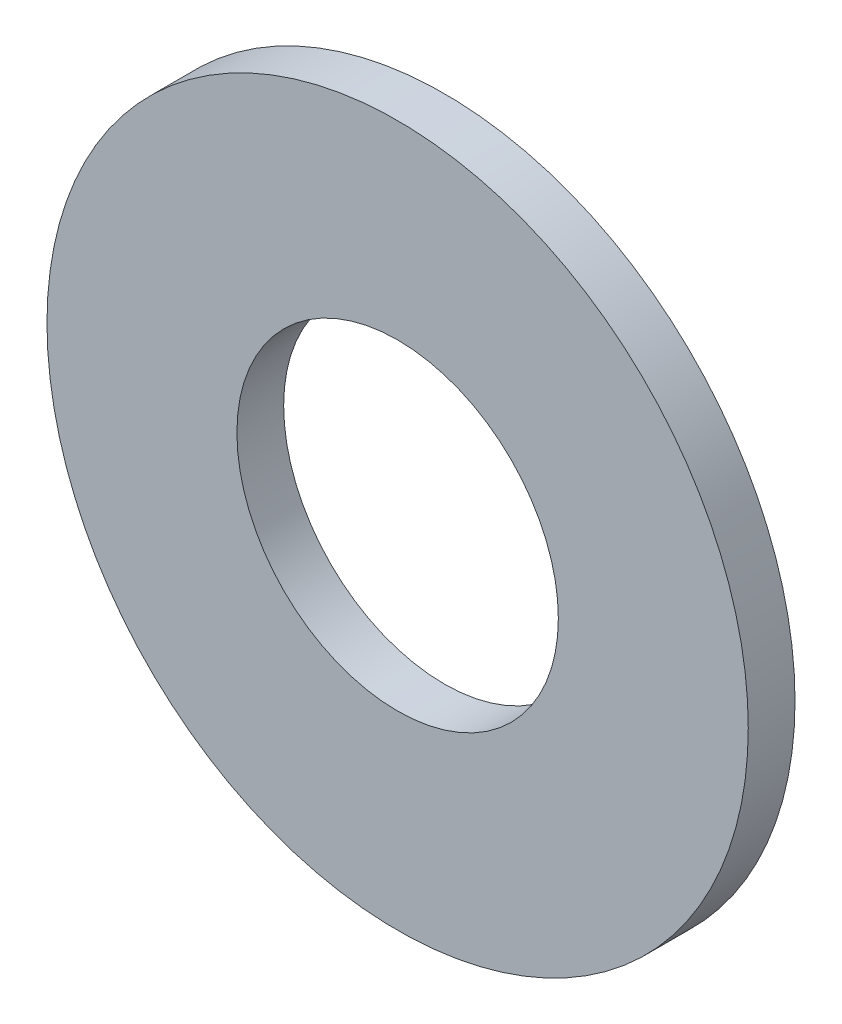
ISO-10303-21;
HEADER;
FILE_DESCRIPTION(('STEP AP214'),'2;1');
FILE_NAME('part.step','',(''),(''),'','','');
FILE_SCHEMA(('AUTOMOTIVE_DESIGN { 1 0 10303 214 1 1 1 1 }'));
ENDSEC;
DATA;
#1=APPLICATION_CONTEXT('core data for automotive mechanical design processes');
#2=APPLICATION_PROTOCOL_DEFINITION('international standard','automotive_design',2000,#1);
#3=PRODUCT_CONTEXT('',#1,'mechanical');
#4=PRODUCT('Part','Part','',(#3));
#5=PRODUCT_RELATED_PRODUCT_CATEGORY('part','',(#4));
#6=PRODUCT_DEFINITION_FORMATION('','',#4);
#7=PRODUCT_DEFINITION_CONTEXT('part definition',#1,'design');
#8=PRODUCT_DEFINITION('design','',#6,#7);
#9=PRODUCT_DEFINITION_SHAPE('','',#8);
#10=(LENGTH_UNIT() NAMED_UNIT(*) SI_UNIT(.MILLI.,.METRE.));
#11=(NAMED_UNIT(*) PLANE_ANGLE_UNIT() SI_UNIT($,.RADIAN.));
#12=(NAMED_UNIT(*) SI_UNIT($,.STERADIAN.) SOLID_ANGLE_UNIT());
#13=UNCERTAINTY_MEASURE_WITH_UNIT(LENGTH_MEASURE(1.E-05),#10,'distance_accuracy_value','');
#14=(GEOMETRIC_REPRESENTATION_CONTEXT(3) GLOBAL_UNCERTAINTY_ASSIGNED_CONTEXT((#13)) GLOBAL_UNIT_ASSIGNED_CONTEXT((#10,
#11,#12)) REPRESENTATION_CONTEXT('',''));
#15=CARTESIAN_POINT('',(0.,0.,0.));
#16=DIRECTION('',(0.,0.,1.));
#17=DIRECTION('',(1.,0.,0.));
#18=AXIS2_PLACEMENT_3D('',#15,#16,#17);
#19=CARTESIAN_POINT('',(0.,0.,0.4));
#20=DIRECTION('',(0.,0.,1.));
#21=DIRECTION('',(1.,0.,0.));
#22=AXIS2_PLACEMENT_3D('',#19,#20,#21);
#23=PLANE('',#22);
#24=CARTESIAN_POINT('',(0.,0.,0.4));
#25=DIRECTION('',(0.,0.,1.));
#26=DIRECTION('',(1.,0.,0.));
#27=AXIS2_PLACEMENT_3D('',#24,#25,#26);
#28=CIRCLE('',#27,6.);
#29=CARTESIAN_POINT('',(6.,0.,0.4));
#30=VERTEX_POINT('',#29);
#31=EDGE_CURVE('E10',#30,#30,#28,.T.);
#32=ORIENTED_EDGE('',*,*,#31,.T.);
#33=EDGE_LOOP('',(#32));
#34=FACE_BOUND('',#33,.T.);
#35=CARTESIAN_POINT('',(0.,0.,0.4));
#36=DIRECTION('',(0.,0.,1.));
#37=DIRECTION('',(1.,0.,0.));
#38=AXIS2_PLACEMENT_3D('',#35,#36,#37);
#39=CIRCLE('',#38,2.75);
#40=CARTESIAN_POINT('',(2.75,0.,0.4));
#41=VERTEX_POINT('',#40);
#42=EDGE_CURVE('E43',#41,#41,#39,.T.);
#43=ORIENTED_EDGE('',*,*,#42,.F.);
#44=EDGE_LOOP('',(#43));
#45=FACE_BOUND('',#44,.T.);
#46=ADVANCED_FACE('F32',(#34,#45),#23,.T.);
#47=CARTESIAN_POINT('',(0.,0.,-0.4));
#48=DIRECTION('',(0.,0.,1.));
#49=DIRECTION('',(1.,0.,0.));
#50=AXIS2_PLACEMENT_3D('',#47,#48,#49);
#51=PLANE('',#50);
#52=CARTESIAN_POINT('',(0.,0.,-0.4));
#53=DIRECTION('',(0.,0.,1.));
#54=DIRECTION('',(1.,0.,0.));
#55=AXIS2_PLACEMENT_3D('',#52,#53,#54);
#56=CIRCLE('',#55,6.);
#57=CARTESIAN_POINT('',(6.,0.,-0.4));
#58=VERTEX_POINT('',#57);
#59=EDGE_CURVE('E36',#58,#58,#56,.T.);
#60=ORIENTED_EDGE('',*,*,#59,.F.);
#61=EDGE_LOOP('',(#60));
#62=FACE_BOUND('',#61,.T.);
#63=CARTESIAN_POINT('',(0.,0.,-0.4));
#64=DIRECTION('',(0.,0.,1.));
#65=DIRECTION('',(1.,0.,0.));
#66=AXIS2_PLACEMENT_3D('',#63,#64,#65);
#67=CIRCLE('',#66,2.75);
#68=CARTESIAN_POINT('',(2.75,0.,-0.4));
#69=VERTEX_POINT('',#68);
#70=EDGE_CURVE('E45',#69,#69,#67,.T.);
#71=ORIENTED_EDGE('',*,*,#70,.T.);
#72=EDGE_LOOP('',(#71));
#73=FACE_BOUND('',#72,.T.);
#74=ADVANCED_FACE('F55',(#62,#73),#51,.F.);
#75=CARTESIAN_POINT('',(0.,0.,0.4));
#76=DIRECTION('',(0.,0.,-1.));
#77=DIRECTION('',(-1.,0.,0.));
#78=AXIS2_PLACEMENT_3D('',#75,#76,#77);
#79=CYLINDRICAL_SURFACE('',#78,6.);
#80=ORIENTED_EDGE('',*,*,#31,.F.);
#81=EDGE_LOOP('',(#80));
#82=FACE_BOUND('',#81,.T.);
#83=ORIENTED_EDGE('',*,*,#59,.T.);
#84=EDGE_LOOP('',(#83));
#85=FACE_BOUND('',#84,.T.);
#86=ADVANCED_FACE('F34',(#82,#85),#79,.T.);
#87=CARTESIAN_POINT('',(0.,0.,0.4));
#88=DIRECTION('',(0.,0.,-1.));
#89=DIRECTION('',(-1.,0.,0.));
#90=AXIS2_PLACEMENT_3D('',#87,#88,#89);
#91=CYLINDRICAL_SURFACE('',#90,2.75);
#92=ORIENTED_EDGE('',*,*,#42,.T.);
#93=EDGE_LOOP('',(#92));
#94=FACE_BOUND('',#93,.T.);
#95=ORIENTED_EDGE('',*,*,#70,.F.);
#96=EDGE_LOOP('',(#95));
#97=FACE_BOUND('',#96,.T.);
#98=ADVANCED_FACE('F51',(#94,#97),#91,.F.);
#99=CLOSED_SHELL('',(#46,#74,#86,#98));
#100=MANIFOLD_SOLID_BREP('B2',#99);
#101=ADVANCED_BREP_SHAPE_REPRESENTATION('',(#18,#100),#14);
#102=SHAPE_DEFINITION_REPRESENTATION(#9,#101);
ENDSEC;
END-ISO-10303-21;
